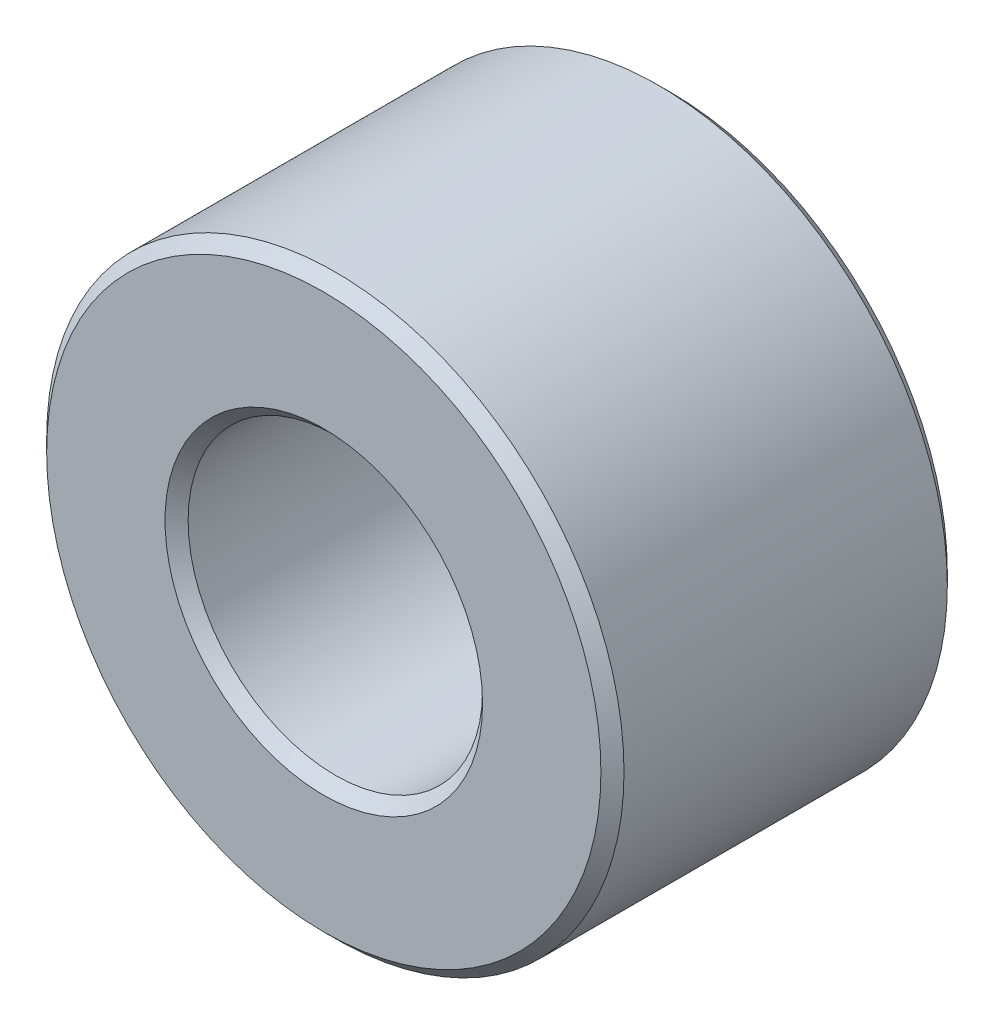
ISO-10303-21;
HEADER;
FILE_DESCRIPTION(('STEP AP214'),'2;1');
FILE_NAME('part.step','',(''),(''),'','','');
FILE_SCHEMA(('AUTOMOTIVE_DESIGN { 1 0 10303 214 1 1 1 1 }'));
ENDSEC;
DATA;
#1=APPLICATION_CONTEXT('core data for automotive mechanical design processes');
#2=APPLICATION_PROTOCOL_DEFINITION('international standard','automotive_design',2000,#1);
#3=PRODUCT_CONTEXT('',#1,'mechanical');
#4=PRODUCT('Part','Part','',(#3));
#5=PRODUCT_RELATED_PRODUCT_CATEGORY('part','',(#4));
#6=PRODUCT_DEFINITION_FORMATION('','',#4);
#7=PRODUCT_DEFINITION_CONTEXT('part definition',#1,'design');
#8=PRODUCT_DEFINITION('design','',#6,#7);
#9=PRODUCT_DEFINITION_SHAPE('','',#8);
#10=(LENGTH_UNIT() NAMED_UNIT(*) SI_UNIT(.MILLI.,.METRE.));
#11=(NAMED_UNIT(*) PLANE_ANGLE_UNIT() SI_UNIT($,.RADIAN.));
#12=(NAMED_UNIT(*) SI_UNIT($,.STERADIAN.) SOLID_ANGLE_UNIT());
#13=UNCERTAINTY_MEASURE_WITH_UNIT(LENGTH_MEASURE(1.E-05),#10,'distance_accuracy_value','');
#14=(GEOMETRIC_REPRESENTATION_CONTEXT(3) GLOBAL_UNCERTAINTY_ASSIGNED_CONTEXT((#13)) GLOBAL_UNIT_ASSIGNED_CONTEXT((#10,
#11,#12)) REPRESENTATION_CONTEXT('',''));
#15=CARTESIAN_POINT('',(0.,0.,0.));
#16=DIRECTION('',(0.,0.,1.));
#17=DIRECTION('',(1.,0.,0.));
#18=AXIS2_PLACEMENT_3D('',#15,#16,#17);
#19=CARTESIAN_POINT('',(0.,0.,6.));
#20=DIRECTION('',(0.,0.,1.));
#21=DIRECTION('',(1.,0.,0.));
#22=AXIS2_PLACEMENT_3D('',#19,#20,#21);
#23=PLANE('',#22);
#24=CARTESIAN_POINT('',(0.,0.,6.));
#25=DIRECTION('',(0.,0.,1.));
#26=DIRECTION('',(1.,0.,0.));
#27=AXIS2_PLACEMENT_3D('',#24,#25,#26);
#28=CIRCLE('',#27,2.75);
#29=CARTESIAN_POINT('',(2.75,0.,6.));
#30=VERTEX_POINT('',#29);
#31=EDGE_CURVE('E10',#30,#30,#28,.F.);
#32=ORIENTED_EDGE('',*,*,#31,.T.);
#33=EDGE_LOOP('',(#32));
#34=FACE_BOUND('',#33,.T.);
#35=CARTESIAN_POINT('',(0.,0.,6.));
#36=DIRECTION('',(0.,0.,1.));
#37=DIRECTION('',(1.,0.,0.));
#38=AXIS2_PLACEMENT_3D('',#35,#36,#37);
#39=CIRCLE('',#38,4.8);
#40=CARTESIAN_POINT('',(4.8,0.,6.));
#41=VERTEX_POINT('',#40);
#42=EDGE_CURVE('E46',#41,#41,#39,.T.);
#43=ORIENTED_EDGE('',*,*,#42,.T.);
#44=EDGE_LOOP('',(#43));
#45=FACE_BOUND('',#44,.T.);
#46=ADVANCED_FACE('F39',(#34,#45),#23,.T.);
#47=CARTESIAN_POINT('',(0.,0.,0.));
#48=DIRECTION('',(0.,0.,1.));
#49=DIRECTION('',(1.,0.,0.));
#50=AXIS2_PLACEMENT_3D('',#47,#48,#49);
#51=PLANE('',#50);
#52=CARTESIAN_POINT('',(0.,0.,0.));
#53=DIRECTION('',(0.,0.,1.));
#54=DIRECTION('',(1.,0.,0.));
#55=AXIS2_PLACEMENT_3D('',#52,#53,#54);
#56=CIRCLE('',#55,4.8);
#57=CARTESIAN_POINT('',(4.8,0.,0.));
#58=VERTEX_POINT('',#57);
#59=EDGE_CURVE('E59',#58,#58,#56,.F.);
#60=ORIENTED_EDGE('',*,*,#59,.T.);
#61=EDGE_LOOP('',(#60));
#62=FACE_BOUND('',#61,.T.);
#63=CARTESIAN_POINT('',(0.,0.,0.));
#64=DIRECTION('',(0.,0.,1.));
#65=DIRECTION('',(1.,0.,0.));
#66=AXIS2_PLACEMENT_3D('',#63,#64,#65);
#67=CIRCLE('',#66,2.75);
#68=CARTESIAN_POINT('',(2.75,0.,0.));
#69=VERTEX_POINT('',#68);
#70=EDGE_CURVE('E62',#69,#69,#67,.T.);
#71=ORIENTED_EDGE('',*,*,#70,.T.);
#72=EDGE_LOOP('',(#71));
#73=FACE_BOUND('',#72,.T.);
#74=ADVANCED_FACE('F83',(#62,#73),#51,.F.);
#75=CARTESIAN_POINT('',(0.,0.,6.));
#76=DIRECTION('',(0.,0.,-1.));
#77=DIRECTION('',(-1.,0.,0.));
#78=AXIS2_PLACEMENT_3D('',#75,#76,#77);
#79=CYLINDRICAL_SURFACE('',#78,5.);
#80=CARTESIAN_POINT('',(0.,0.,0.199999999999998));
#81=DIRECTION('',(0.,0.,1.));
#82=DIRECTION('',(1.,0.,0.));
#83=AXIS2_PLACEMENT_3D('',#80,#81,#82);
#84=CIRCLE('',#83,5.);
#85=CARTESIAN_POINT('',(5.,0.,0.199999999999998));
#86=VERTEX_POINT('',#85);
#87=EDGE_CURVE('E65',#86,#86,#84,.T.);
#88=ORIENTED_EDGE('',*,*,#87,.T.);
#89=EDGE_LOOP('',(#88));
#90=FACE_BOUND('',#89,.T.);
#91=CARTESIAN_POINT('',(0.,0.,5.8));
#92=DIRECTION('',(0.,0.,1.));
#93=DIRECTION('',(1.,0.,0.));
#94=AXIS2_PLACEMENT_3D('',#91,#92,#93);
#95=CIRCLE('',#94,5.);
#96=CARTESIAN_POINT('',(5.,0.,5.8));
#97=VERTEX_POINT('',#96);
#98=EDGE_CURVE('E68',#97,#97,#95,.F.);
#99=ORIENTED_EDGE('',*,*,#98,.T.);
#100=EDGE_LOOP('',(#99));
#101=FACE_BOUND('',#100,.T.);
#102=ADVANCED_FACE('F72',(#90,#101),#79,.T.);
#103=CARTESIAN_POINT('',(0.,0.,6.));
#104=DIRECTION('',(0.,0.,-1.));
#105=DIRECTION('',(-1.,0.,0.));
#106=AXIS2_PLACEMENT_3D('',#103,#104,#105);
#107=CYLINDRICAL_SURFACE('',#106,2.55);
#108=CARTESIAN_POINT('',(0.,0.,0.200000000000003));
#109=DIRECTION('',(0.,0.,1.));
#110=DIRECTION('',(1.,0.,0.));
#111=AXIS2_PLACEMENT_3D('',#108,#109,#110);
#112=CIRCLE('',#111,2.55);
#113=CARTESIAN_POINT('',(2.55,0.,0.200000000000003));
#114=VERTEX_POINT('',#113);
#115=EDGE_CURVE('E50',#114,#114,#112,.F.);
#116=ORIENTED_EDGE('',*,*,#115,.T.);
#117=EDGE_LOOP('',(#116));
#118=FACE_BOUND('',#117,.T.);
#119=CARTESIAN_POINT('',(0.,0.,5.8));
#120=DIRECTION('',(0.,0.,1.));
#121=DIRECTION('',(1.,0.,0.));
#122=AXIS2_PLACEMENT_3D('',#119,#120,#121);
#123=CIRCLE('',#122,2.55);
#124=CARTESIAN_POINT('',(2.55,0.,5.8));
#125=VERTEX_POINT('',#124);
#126=EDGE_CURVE('E54',#125,#125,#123,.T.);
#127=ORIENTED_EDGE('',*,*,#126,.T.);
#128=EDGE_LOOP('',(#127));
#129=FACE_BOUND('',#128,.T.);
#130=ADVANCED_FACE('F91',(#118,#129),#107,.F.);
#131=CARTESIAN_POINT('',(0.,0.,0.199999999999998));
#132=DIRECTION('',(0.,0.,1.));
#133=DIRECTION('',(1.,0.,0.));
#134=AXIS2_PLACEMENT_3D('',#131,#132,#133);
#135=CONICAL_SURFACE('',#134,5.,0.785398163397455);
#136=ORIENTED_EDGE('',*,*,#59,.F.);
#137=EDGE_LOOP('',(#136));
#138=FACE_BOUND('',#137,.T.);
#139=ORIENTED_EDGE('',*,*,#87,.F.);
#140=EDGE_LOOP('',(#139));
#141=FACE_BOUND('',#140,.T.);
#142=ADVANCED_FACE('F96',(#138,#141),#135,.T.);
#143=CARTESIAN_POINT('',(0.,0.,0.));
#144=DIRECTION('',(0.,0.,-1.));
#145=DIRECTION('',(-1.,0.,0.));
#146=AXIS2_PLACEMENT_3D('',#143,#144,#145);
#147=CONICAL_SURFACE('',#146,2.75,0.785398163397443);
#148=ORIENTED_EDGE('',*,*,#115,.F.);
#149=EDGE_LOOP('',(#148));
#150=FACE_BOUND('',#149,.T.);
#151=ORIENTED_EDGE('',*,*,#70,.F.);
#152=EDGE_LOOP('',(#151));
#153=FACE_BOUND('',#152,.T.);
#154=ADVANCED_FACE('F80',(#150,#153),#147,.F.);
#155=CARTESIAN_POINT('',(0.,0.,5.8));
#156=DIRECTION('',(0.,0.,1.));
#157=DIRECTION('',(1.,0.,0.));
#158=AXIS2_PLACEMENT_3D('',#155,#156,#157);
#159=CONICAL_SURFACE('',#158,2.55,0.785398163397454);
#160=ORIENTED_EDGE('',*,*,#31,.F.);
#161=EDGE_LOOP('',(#160));
#162=FACE_BOUND('',#161,.T.);
#163=ORIENTED_EDGE('',*,*,#126,.F.);
#164=EDGE_LOOP('',(#163));
#165=FACE_BOUND('',#164,.T.);
#166=ADVANCED_FACE('F76',(#162,#165),#159,.F.);
#167=CARTESIAN_POINT('',(0.,0.,6.));
#168=DIRECTION('',(0.,0.,-1.));
#169=DIRECTION('',(-1.,0.,0.));
#170=AXIS2_PLACEMENT_3D('',#167,#168,#169);
#171=CONICAL_SURFACE('',#170,4.8,0.785398163397448);
#172=ORIENTED_EDGE('',*,*,#98,.F.);
#173=EDGE_LOOP('',(#172));
#174=FACE_BOUND('',#173,.T.);
#175=ORIENTED_EDGE('',*,*,#42,.F.);
#176=EDGE_LOOP('',(#175));
#177=FACE_BOUND('',#176,.T.);
#178=ADVANCED_FACE('F41',(#174,#177),#171,.T.);
#179=CLOSED_SHELL('',(#46,#74,#102,#130,#142,#154,#166,#178));
#180=MANIFOLD_SOLID_BREP('B2',#179);
#181=ADVANCED_BREP_SHAPE_REPRESENTATION('',(#18,#180),#14);
#182=SHAPE_DEFINITION_REPRESENTATION(#9,#181);
ENDSEC;
END-ISO-10303-21;
